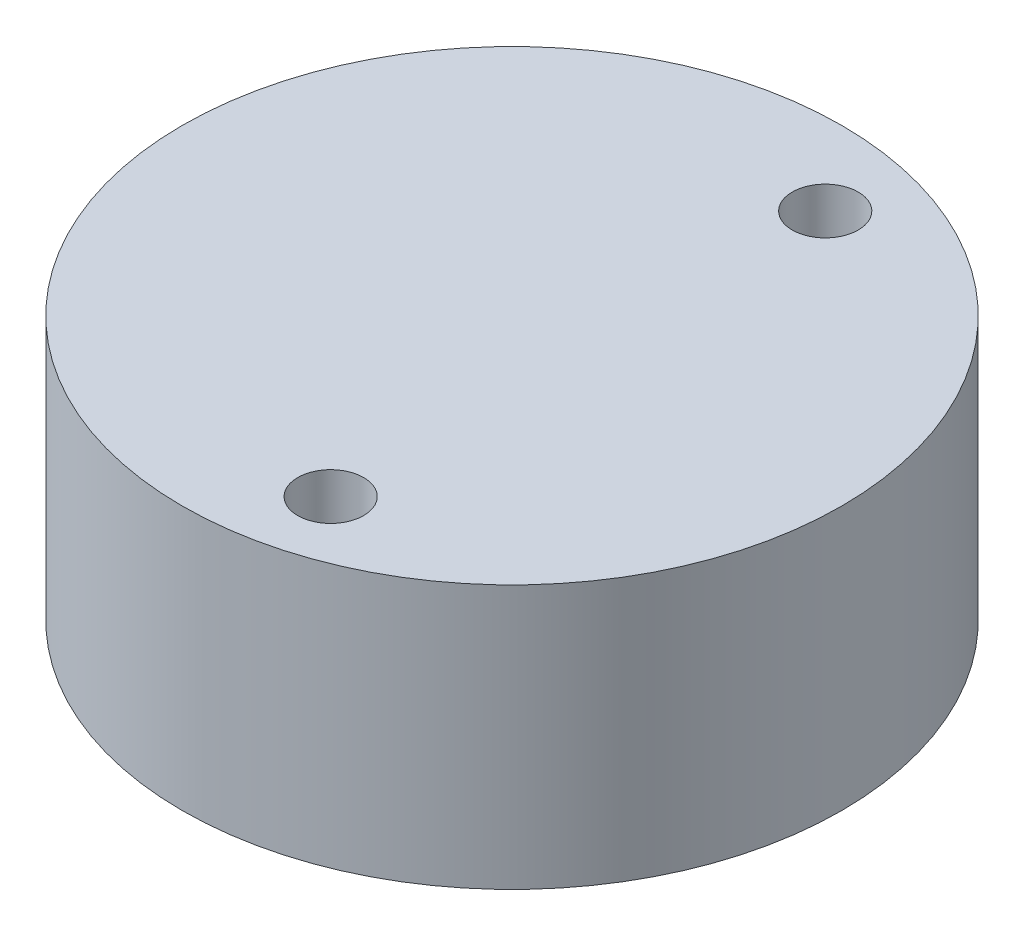
ISO-10303-21;
HEADER;
FILE_DESCRIPTION(('STEP AP214'),'2;1');
FILE_NAME('part.step','',(''),(''),'','','');
FILE_SCHEMA(('AUTOMOTIVE_DESIGN { 1 0 10303 214 1 1 1 1 }'));
ENDSEC;
DATA;
#1=APPLICATION_CONTEXT('core data for automotive mechanical design processes');
#2=APPLICATION_PROTOCOL_DEFINITION('international standard','automotive_design',2000,#1);
#3=PRODUCT_CONTEXT('',#1,'mechanical');
#4=PRODUCT('Part','Part','',(#3));
#5=PRODUCT_RELATED_PRODUCT_CATEGORY('part','',(#4));
#6=PRODUCT_DEFINITION_FORMATION('','',#4);
#7=PRODUCT_DEFINITION_CONTEXT('part definition',#1,'design');
#8=PRODUCT_DEFINITION('design','',#6,#7);
#9=PRODUCT_DEFINITION_SHAPE('','',#8);
#10=(LENGTH_UNIT() NAMED_UNIT(*) SI_UNIT(.MILLI.,.METRE.));
#11=(NAMED_UNIT(*) PLANE_ANGLE_UNIT() SI_UNIT($,.RADIAN.));
#12=(NAMED_UNIT(*) SI_UNIT($,.STERADIAN.) SOLID_ANGLE_UNIT());
#13=UNCERTAINTY_MEASURE_WITH_UNIT(LENGTH_MEASURE(1.E-05),#10,'distance_accuracy_value','');
#14=(GEOMETRIC_REPRESENTATION_CONTEXT(3) GLOBAL_UNCERTAINTY_ASSIGNED_CONTEXT((#13)) GLOBAL_UNIT_ASSIGNED_CONTEXT((#10,
#11,#12)) REPRESENTATION_CONTEXT('',''));
#15=CARTESIAN_POINT('',(0.,0.,0.));
#16=DIRECTION('',(0.,0.,1.));
#17=DIRECTION('',(1.,0.,0.));
#18=AXIS2_PLACEMENT_3D('',#15,#16,#17);
#19=CARTESIAN_POINT('',(-1.,0.,0.));
#20=DIRECTION('',(0.,1.,0.));
#21=DIRECTION('',(0.,0.,1.));
#22=AXIS2_PLACEMENT_3D('',#19,#20,#21);
#23=PLANE('',#22);
#24=CARTESIAN_POINT('',(0.,0.,3.75));
#25=DIRECTION('',(0.,-1.,0.));
#26=DIRECTION('',(0.,0.,-1.));
#27=AXIS2_PLACEMENT_3D('',#24,#25,#26);
#28=CIRCLE('',#27,0.5);
#29=CARTESIAN_POINT('',(0.,0.,3.25));
#30=VERTEX_POINT('',#29);
#31=EDGE_CURVE('E85',#30,#30,#28,.T.);
#32=ORIENTED_EDGE('',*,*,#31,.F.);
#33=EDGE_LOOP('',(#32));
#34=FACE_BOUND('',#33,.T.);
#35=CARTESIAN_POINT('',(0.,0.,-3.75));
#36=DIRECTION('',(0.,-1.,0.));
#37=DIRECTION('',(0.,0.,-1.));
#38=AXIS2_PLACEMENT_3D('',#35,#36,#37);
#39=CIRCLE('',#38,0.5);
#40=CARTESIAN_POINT('',(0.,0.,-4.25));
#41=VERTEX_POINT('',#40);
#42=EDGE_CURVE('E79',#41,#41,#39,.T.);
#43=ORIENTED_EDGE('',*,*,#42,.F.);
#44=EDGE_LOOP('',(#43));
#45=FACE_BOUND('',#44,.T.);
#46=CARTESIAN_POINT('',(-1.,0.,0.));
#47=DIRECTION('',(0.,1.,0.));
#48=DIRECTION('',(0.,0.,1.));
#49=AXIS2_PLACEMENT_3D('',#46,#47,#48);
#50=CIRCLE('',#49,5.);
#51=CARTESIAN_POINT('',(-1.,0.,5.));
#52=VERTEX_POINT('',#51);
#53=EDGE_CURVE('E11',#52,#52,#50,.T.);
#54=ORIENTED_EDGE('',*,*,#53,.F.);
#55=EDGE_LOOP('',(#54));
#56=FACE_BOUND('',#55,.T.);
#57=CARTESIAN_POINT('',(0.,0.,0.));
#58=DIRECTION('',(0.,1.,0.));
#59=DIRECTION('',(0.,0.,1.));
#60=AXIS2_PLACEMENT_3D('',#57,#58,#59);
#61=CIRCLE('',#60,3.);
#62=CARTESIAN_POINT('',(-2.,0.,2.23606797749979));
#63=VERTEX_POINT('',#62);
#64=CARTESIAN_POINT('',(-2.,0.,-2.23606797749979));
#65=VERTEX_POINT('',#64);
#66=EDGE_CURVE('E43',#63,#65,#61,.T.);
#67=ORIENTED_EDGE('',*,*,#66,.T.);
#68=DIRECTION('',(0.,0.,1.));
#69=VECTOR('',#68,1.);
#70=CARTESIAN_POINT('',(-2.,0.,0.));
#71=LINE('',#70,#69);
#72=EDGE_CURVE('E60',#65,#63,#71,.T.);
#73=ORIENTED_EDGE('',*,*,#72,.T.);
#74=EDGE_LOOP('',(#67,#73));
#75=FACE_BOUND('',#74,.T.);
#76=ADVANCED_FACE('F35',(#34,#45,#56,#75),#23,.F.);
#77=CARTESIAN_POINT('',(-1.,2.,0.));
#78=DIRECTION('',(0.,-1.,0.));
#79=DIRECTION('',(0.,0.,-1.));
#80=AXIS2_PLACEMENT_3D('',#77,#78,#79);
#81=CYLINDRICAL_SURFACE('',#80,5.);
#82=ORIENTED_EDGE('',*,*,#53,.T.);
#83=EDGE_LOOP('',(#82));
#84=FACE_BOUND('',#83,.T.);
#85=CARTESIAN_POINT('',(-1.,4.,0.));
#86=DIRECTION('',(0.,1.,0.));
#87=DIRECTION('',(0.,0.,1.));
#88=AXIS2_PLACEMENT_3D('',#85,#86,#87);
#89=CIRCLE('',#88,5.);
#90=CARTESIAN_POINT('',(-1.,4.,5.));
#91=VERTEX_POINT('',#90);
#92=EDGE_CURVE('E73',#91,#91,#89,.T.);
#93=ORIENTED_EDGE('',*,*,#92,.F.);
#94=EDGE_LOOP('',(#93));
#95=FACE_BOUND('',#94,.T.);
#96=ADVANCED_FACE('F37',(#84,#95),#81,.T.);
#97=CARTESIAN_POINT('',(0.,2.,0.));
#98=DIRECTION('',(0.,-1.,0.));
#99=DIRECTION('',(0.,0.,-1.));
#100=AXIS2_PLACEMENT_3D('',#97,#98,#99);
#101=CYLINDRICAL_SURFACE('',#100,3.);
#102=DIRECTION('',(0.,-1.,0.));
#103=VECTOR('',#102,1.);
#104=CARTESIAN_POINT('',(-2.,4.,2.23606797749979));
#105=LINE('',#104,#103);
#106=CARTESIAN_POINT('',(-2.,2.,2.23606797749979));
#107=VERTEX_POINT('',#106);
#108=EDGE_CURVE('E62',#107,#63,#105,.T.);
#109=ORIENTED_EDGE('',*,*,#108,.F.);
#110=CARTESIAN_POINT('',(0.,2.,0.));
#111=DIRECTION('',(0.,1.,0.));
#112=DIRECTION('',(0.,0.,1.));
#113=AXIS2_PLACEMENT_3D('',#110,#111,#112);
#114=CIRCLE('',#113,3.);
#115=CARTESIAN_POINT('',(-2.,2.,-2.23606797749979));
#116=VERTEX_POINT('',#115);
#117=EDGE_CURVE('E71',#107,#116,#114,.T.);
#118=ORIENTED_EDGE('',*,*,#117,.T.);
#119=DIRECTION('',(0.,-1.,0.));
#120=VECTOR('',#119,1.);
#121=CARTESIAN_POINT('',(-2.,4.,-2.23606797749979));
#122=LINE('',#121,#120);
#123=EDGE_CURVE('E50',#116,#65,#122,.T.);
#124=ORIENTED_EDGE('',*,*,#123,.T.);
#125=ORIENTED_EDGE('',*,*,#66,.F.);
#126=EDGE_LOOP('',(#109,#118,#124,#125));
#127=FACE_BOUND('',#126,.T.);
#128=ADVANCED_FACE('F69',(#127),#101,.F.);
#129=CARTESIAN_POINT('',(-1.,2.,0.));
#130=DIRECTION('',(0.,1.,0.));
#131=DIRECTION('',(0.,0.,1.));
#132=AXIS2_PLACEMENT_3D('',#129,#130,#131);
#133=PLANE('',#132);
#134=ORIENTED_EDGE('',*,*,#117,.F.);
#135=DIRECTION('',(0.,0.,-1.));
#136=VECTOR('',#135,1.);
#137=CARTESIAN_POINT('',(-2.,2.,0.));
#138=LINE('',#137,#136);
#139=EDGE_CURVE('E54',#107,#116,#138,.T.);
#140=ORIENTED_EDGE('',*,*,#139,.T.);
#141=EDGE_LOOP('',(#134,#140));
#142=FACE_BOUND('',#141,.T.);
#143=ADVANCED_FACE('F92',(#142),#133,.F.);
#144=CARTESIAN_POINT('',(-1.,4.,0.));
#145=DIRECTION('',(0.,1.,0.));
#146=DIRECTION('',(0.,0.,1.));
#147=AXIS2_PLACEMENT_3D('',#144,#145,#146);
#148=PLANE('',#147);
#149=CARTESIAN_POINT('',(0.,4.,3.75));
#150=DIRECTION('',(0.,-1.,0.));
#151=DIRECTION('',(0.,0.,-1.));
#152=AXIS2_PLACEMENT_3D('',#149,#150,#151);
#153=CIRCLE('',#152,0.5);
#154=CARTESIAN_POINT('',(0.,4.,3.25));
#155=VERTEX_POINT('',#154);
#156=EDGE_CURVE('E78',#155,#155,#153,.T.);
#157=ORIENTED_EDGE('',*,*,#156,.T.);
#158=EDGE_LOOP('',(#157));
#159=FACE_BOUND('',#158,.T.);
#160=CARTESIAN_POINT('',(0.,4.,-3.75));
#161=DIRECTION('',(0.,-1.,0.));
#162=DIRECTION('',(0.,0.,-1.));
#163=AXIS2_PLACEMENT_3D('',#160,#161,#162);
#164=CIRCLE('',#163,0.5);
#165=CARTESIAN_POINT('',(0.,4.,-4.25));
#166=VERTEX_POINT('',#165);
#167=EDGE_CURVE('E82',#166,#166,#164,.T.);
#168=ORIENTED_EDGE('',*,*,#167,.T.);
#169=EDGE_LOOP('',(#168));
#170=FACE_BOUND('',#169,.T.);
#171=ORIENTED_EDGE('',*,*,#92,.T.);
#172=EDGE_LOOP('',(#171));
#173=FACE_BOUND('',#172,.T.);
#174=ADVANCED_FACE('F94',(#159,#170,#173),#148,.T.);
#175=CARTESIAN_POINT('',(0.,4.,-3.75));
#176=DIRECTION('',(0.,-1.,0.));
#177=DIRECTION('',(0.,0.,-1.));
#178=AXIS2_PLACEMENT_3D('',#175,#176,#177);
#179=CYLINDRICAL_SURFACE('',#178,0.5);
#180=ORIENTED_EDGE('',*,*,#167,.F.);
#181=EDGE_LOOP('',(#180));
#182=FACE_BOUND('',#181,.T.);
#183=ORIENTED_EDGE('',*,*,#42,.T.);
#184=EDGE_LOOP('',(#183));
#185=FACE_BOUND('',#184,.T.);
#186=ADVANCED_FACE('F100',(#182,#185),#179,.F.);
#187=CARTESIAN_POINT('',(0.,4.,3.75));
#188=DIRECTION('',(0.,-1.,0.));
#189=DIRECTION('',(0.,0.,-1.));
#190=AXIS2_PLACEMENT_3D('',#187,#188,#189);
#191=CYLINDRICAL_SURFACE('',#190,0.5);
#192=ORIENTED_EDGE('',*,*,#156,.F.);
#193=EDGE_LOOP('',(#192));
#194=FACE_BOUND('',#193,.T.);
#195=ORIENTED_EDGE('',*,*,#31,.T.);
#196=EDGE_LOOP('',(#195));
#197=FACE_BOUND('',#196,.T.);
#198=ADVANCED_FACE('F122',(#194,#197),#191,.F.);
#199=CARTESIAN_POINT('',(-2.,4.,0.));
#200=DIRECTION('',(1.,0.,0.));
#201=DIRECTION('',(0.,0.,-1.));
#202=AXIS2_PLACEMENT_3D('',#199,#200,#201);
#203=PLANE('',#202);
#204=ORIENTED_EDGE('',*,*,#139,.F.);
#205=ORIENTED_EDGE('',*,*,#108,.T.);
#206=ORIENTED_EDGE('',*,*,#72,.F.);
#207=ORIENTED_EDGE('',*,*,#123,.F.);
#208=EDGE_LOOP('',(#204,#205,#206,#207));
#209=FACE_BOUND('',#208,.T.);
#210=ADVANCED_FACE('F61',(#209),#203,.T.);
#211=CLOSED_SHELL('',(#76,#96,#128,#143,#174,#186,#198,#210));
#212=MANIFOLD_SOLID_BREP('B2',#211);
#213=ADVANCED_BREP_SHAPE_REPRESENTATION('',(#18,#212),#14);
#214=SHAPE_DEFINITION_REPRESENTATION(#9,#213);
ENDSEC;
END-ISO-10303-21;
